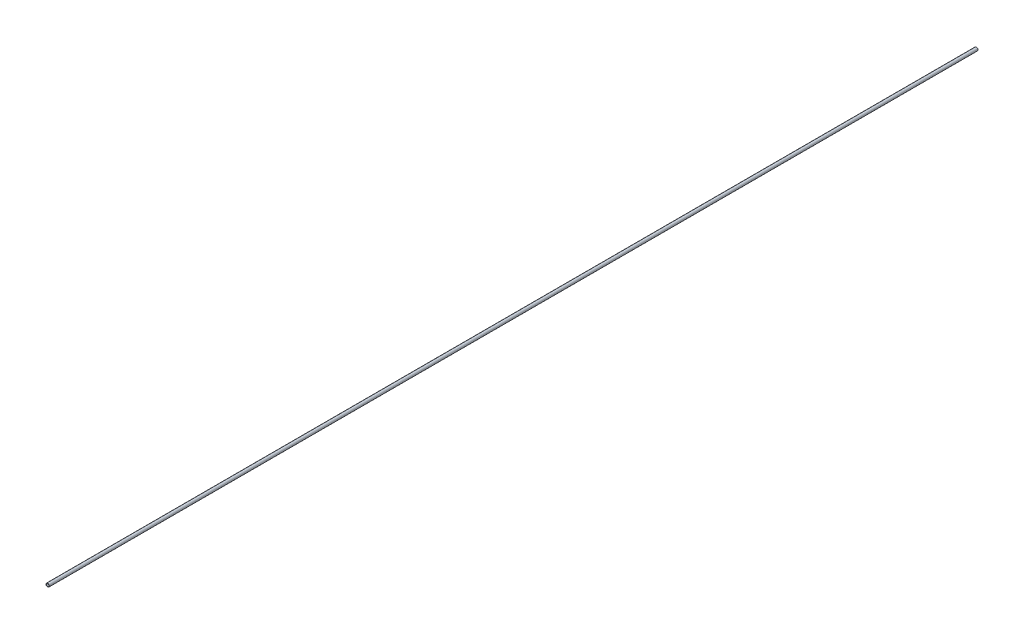
ISO-10303-21;
HEADER;
FILE_DESCRIPTION(('STEP AP214'),'2;1');
FILE_NAME('part.step','',(''),(''),'','','');
FILE_SCHEMA(('AUTOMOTIVE_DESIGN { 1 0 10303 214 1 1 1 1 }'));
ENDSEC;
DATA;
#1=APPLICATION_CONTEXT('core data for automotive mechanical design processes');
#2=APPLICATION_PROTOCOL_DEFINITION('international standard','automotive_design',2000,#1);
#3=PRODUCT_CONTEXT('',#1,'mechanical');
#4=PRODUCT('Part','Part','',(#3));
#5=PRODUCT_RELATED_PRODUCT_CATEGORY('part','',(#4));
#6=PRODUCT_DEFINITION_FORMATION('','',#4);
#7=PRODUCT_DEFINITION_CONTEXT('part definition',#1,'design');
#8=PRODUCT_DEFINITION('design','',#6,#7);
#9=PRODUCT_DEFINITION_SHAPE('','',#8);
#10=(LENGTH_UNIT() NAMED_UNIT(*) SI_UNIT(.MILLI.,.METRE.));
#11=(NAMED_UNIT(*) PLANE_ANGLE_UNIT() SI_UNIT($,.RADIAN.));
#12=(NAMED_UNIT(*) SI_UNIT($,.STERADIAN.) SOLID_ANGLE_UNIT());
#13=UNCERTAINTY_MEASURE_WITH_UNIT(LENGTH_MEASURE(1.E-05),#10,'distance_accuracy_value','');
#14=(GEOMETRIC_REPRESENTATION_CONTEXT(3) GLOBAL_UNCERTAINTY_ASSIGNED_CONTEXT((#13)) GLOBAL_UNIT_ASSIGNED_CONTEXT((#10,
#11,#12)) REPRESENTATION_CONTEXT('',''));
#15=CARTESIAN_POINT('',(0.,0.,0.));
#16=DIRECTION('',(0.,0.,1.));
#17=DIRECTION('',(1.,0.,0.));
#18=AXIS2_PLACEMENT_3D('',#15,#16,#17);
#19=CARTESIAN_POINT('',(0.,0.,3000.));
#20=DIRECTION('',(0.,0.,1.));
#21=DIRECTION('',(1.,0.,0.));
#22=AXIS2_PLACEMENT_3D('',#19,#20,#21);
#23=PLANE('',#22);
#24=CARTESIAN_POINT('',(0.,0.,3000.));
#25=DIRECTION('',(0.,0.,1.));
#26=DIRECTION('',(1.,0.,0.));
#27=AXIS2_PLACEMENT_3D('',#24,#25,#26);
#28=CIRCLE('',#27,10.668);
#29=CARTESIAN_POINT('',(10.668,0.,3000.));
#30=VERTEX_POINT('',#29);
#31=EDGE_CURVE('E11',#30,#30,#28,.T.);
#32=ORIENTED_EDGE('',*,*,#31,.T.);
#33=EDGE_LOOP('',(#32));
#34=FACE_BOUND('',#33,.T.);
#35=CARTESIAN_POINT('',(0.,0.,3000.));
#36=DIRECTION('',(0.,0.,1.));
#37=DIRECTION('',(1.,0.,0.));
#38=AXIS2_PLACEMENT_3D('',#35,#36,#37);
#39=CIRCLE('',#38,7.8994);
#40=CARTESIAN_POINT('',(7.8994,0.,3000.));
#41=VERTEX_POINT('',#40);
#42=EDGE_CURVE('E48',#41,#41,#39,.T.);
#43=ORIENTED_EDGE('',*,*,#42,.F.);
#44=EDGE_LOOP('',(#43));
#45=FACE_BOUND('',#44,.T.);
#46=ADVANCED_FACE('F37',(#34,#45),#23,.T.);
#47=CARTESIAN_POINT('',(0.,0.,-3000.));
#48=DIRECTION('',(0.,0.,1.));
#49=DIRECTION('',(1.,0.,0.));
#50=AXIS2_PLACEMENT_3D('',#47,#48,#49);
#51=PLANE('',#50);
#52=CARTESIAN_POINT('',(0.,0.,-3000.));
#53=DIRECTION('',(0.,0.,1.));
#54=DIRECTION('',(1.,0.,0.));
#55=AXIS2_PLACEMENT_3D('',#52,#53,#54);
#56=CIRCLE('',#55,10.668);
#57=CARTESIAN_POINT('',(10.668,0.,-3000.));
#58=VERTEX_POINT('',#57);
#59=EDGE_CURVE('E41',#58,#58,#56,.T.);
#60=ORIENTED_EDGE('',*,*,#59,.F.);
#61=EDGE_LOOP('',(#60));
#62=FACE_BOUND('',#61,.T.);
#63=CARTESIAN_POINT('',(0.,0.,-3000.));
#64=DIRECTION('',(0.,0.,1.));
#65=DIRECTION('',(1.,0.,0.));
#66=AXIS2_PLACEMENT_3D('',#63,#64,#65);
#67=CIRCLE('',#66,7.8994);
#68=CARTESIAN_POINT('',(7.8994,0.,-3000.));
#69=VERTEX_POINT('',#68);
#70=EDGE_CURVE('E50',#69,#69,#67,.T.);
#71=ORIENTED_EDGE('',*,*,#70,.T.);
#72=EDGE_LOOP('',(#71));
#73=FACE_BOUND('',#72,.T.);
#74=ADVANCED_FACE('F60',(#62,#73),#51,.F.);
#75=CARTESIAN_POINT('',(0.,0.,3000.));
#76=DIRECTION('',(0.,0.,-1.));
#77=DIRECTION('',(-1.,0.,0.));
#78=AXIS2_PLACEMENT_3D('',#75,#76,#77);
#79=CYLINDRICAL_SURFACE('',#78,10.668);
#80=ORIENTED_EDGE('',*,*,#31,.F.);
#81=EDGE_LOOP('',(#80));
#82=FACE_BOUND('',#81,.T.);
#83=ORIENTED_EDGE('',*,*,#59,.T.);
#84=EDGE_LOOP('',(#83));
#85=FACE_BOUND('',#84,.T.);
#86=ADVANCED_FACE('F39',(#82,#85),#79,.T.);
#87=CARTESIAN_POINT('',(0.,0.,3000.));
#88=DIRECTION('',(0.,0.,-1.));
#89=DIRECTION('',(-1.,0.,0.));
#90=AXIS2_PLACEMENT_3D('',#87,#88,#89);
#91=CYLINDRICAL_SURFACE('',#90,7.8994);
#92=ORIENTED_EDGE('',*,*,#42,.T.);
#93=EDGE_LOOP('',(#92));
#94=FACE_BOUND('',#93,.T.);
#95=ORIENTED_EDGE('',*,*,#70,.F.);
#96=EDGE_LOOP('',(#95));
#97=FACE_BOUND('',#96,.T.);
#98=ADVANCED_FACE('F56',(#94,#97),#91,.F.);
#99=CLOSED_SHELL('',(#46,#74,#86,#98));
#100=MANIFOLD_SOLID_BREP('B2',#99);
#101=ADVANCED_BREP_SHAPE_REPRESENTATION('',(#18,#100),#14);
#102=SHAPE_DEFINITION_REPRESENTATION(#9,#101);
ENDSEC;
END-ISO-10303-21;
